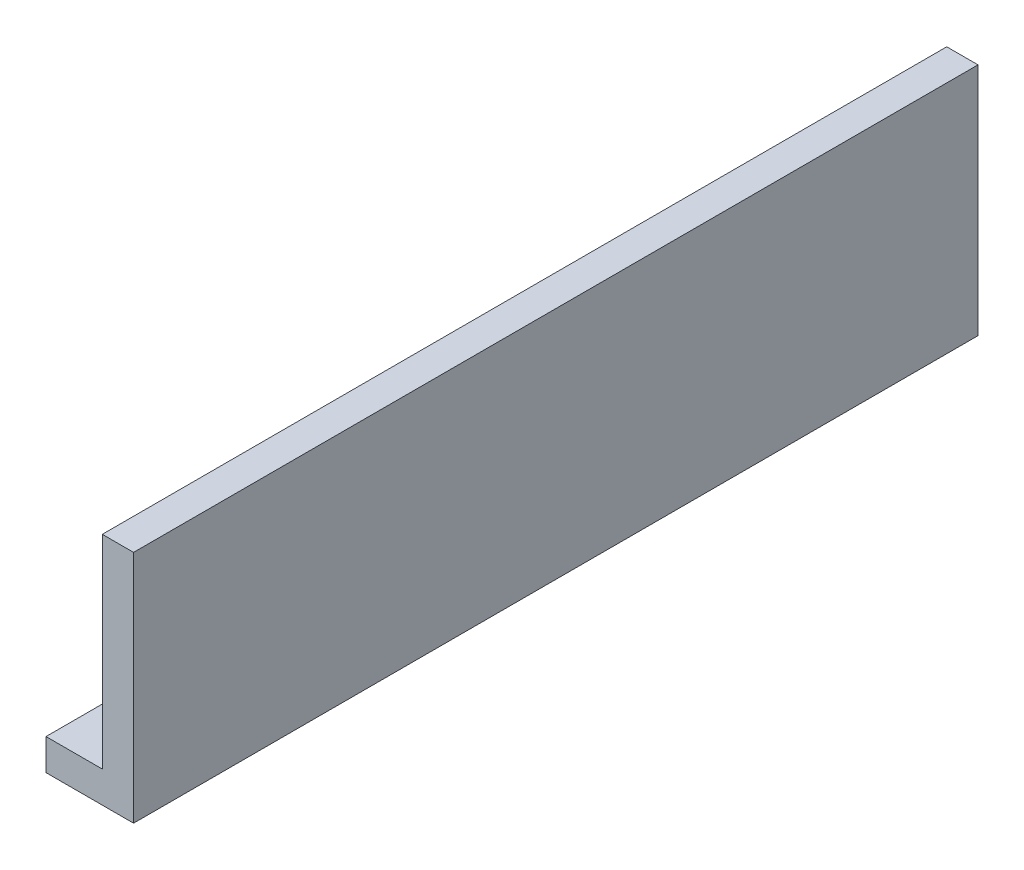
ISO-10303-21;
HEADER;
FILE_DESCRIPTION(('STEP AP214'),'2;1');
FILE_NAME('part.step','',(''),(''),'','','');
FILE_SCHEMA(('AUTOMOTIVE_DESIGN { 1 0 10303 214 1 1 1 1 }'));
ENDSEC;
DATA;
#1=APPLICATION_CONTEXT('core data for automotive mechanical design processes');
#2=APPLICATION_PROTOCOL_DEFINITION('international standard','automotive_design',2000,#1);
#3=PRODUCT_CONTEXT('',#1,'mechanical');
#4=PRODUCT('Part','Part','',(#3));
#5=PRODUCT_RELATED_PRODUCT_CATEGORY('part','',(#4));
#6=PRODUCT_DEFINITION_FORMATION('','',#4);
#7=PRODUCT_DEFINITION_CONTEXT('part definition',#1,'design');
#8=PRODUCT_DEFINITION('design','',#6,#7);
#9=PRODUCT_DEFINITION_SHAPE('','',#8);
#10=(LENGTH_UNIT() NAMED_UNIT(*) SI_UNIT(.MILLI.,.METRE.));
#11=(NAMED_UNIT(*) PLANE_ANGLE_UNIT() SI_UNIT($,.RADIAN.));
#12=(NAMED_UNIT(*) SI_UNIT($,.STERADIAN.) SOLID_ANGLE_UNIT());
#13=UNCERTAINTY_MEASURE_WITH_UNIT(LENGTH_MEASURE(1.E-05),#10,'distance_accuracy_value','');
#14=(GEOMETRIC_REPRESENTATION_CONTEXT(3) GLOBAL_UNCERTAINTY_ASSIGNED_CONTEXT((#13)) GLOBAL_UNIT_ASSIGNED_CONTEXT((#10,
#11,#12)) REPRESENTATION_CONTEXT('',''));
#15=CARTESIAN_POINT('',(0.,0.,0.));
#16=DIRECTION('',(0.,0.,1.));
#17=DIRECTION('',(1.,0.,0.));
#18=AXIS2_PLACEMENT_3D('',#15,#16,#17);
#19=CARTESIAN_POINT('',(0.,150.,270.));
#20=DIRECTION('',(1.,0.,0.));
#21=DIRECTION('',(0.,0.,-1.));
#22=AXIS2_PLACEMENT_3D('',#19,#20,#21);
#23=PLANE('',#22);
#24=DIRECTION('',(0.,-1.,0.));
#25=VECTOR('',#24,1.);
#26=CARTESIAN_POINT('',(0.,150.,-270.));
#27=LINE('',#26,#25);
#28=CARTESIAN_POINT('',(0.,150.,-270.));
#29=VERTEX_POINT('',#28);
#30=CARTESIAN_POINT('',(0.,20.,-270.));
#31=VERTEX_POINT('',#30);
#32=EDGE_CURVE('E160',#29,#31,#27,.T.);
#33=ORIENTED_EDGE('',*,*,#32,.T.);
#34=DIRECTION('',(0.,0.,1.));
#35=VECTOR('',#34,1.);
#36=CARTESIAN_POINT('',(0.,20.,270.));
#37=LINE('',#36,#35);
#38=CARTESIAN_POINT('',(0.,20.,270.));
#39=VERTEX_POINT('',#38);
#40=EDGE_CURVE('E131',#31,#39,#37,.T.);
#41=ORIENTED_EDGE('',*,*,#40,.T.);
#42=DIRECTION('',(0.,-1.,0.));
#43=VECTOR('',#42,1.);
#44=CARTESIAN_POINT('',(0.,150.,270.));
#45=LINE('',#44,#43);
#46=CARTESIAN_POINT('',(0.,150.,270.));
#47=VERTEX_POINT('',#46);
#48=EDGE_CURVE('E11',#47,#39,#45,.T.);
#49=ORIENTED_EDGE('',*,*,#48,.F.);
#50=DIRECTION('',(0.,0.,1.));
#51=VECTOR('',#50,1.);
#52=CARTESIAN_POINT('',(0.,150.,270.));
#53=LINE('',#52,#51);
#54=EDGE_CURVE('E150',#29,#47,#53,.T.);
#55=ORIENTED_EDGE('',*,*,#54,.F.);
#56=EDGE_LOOP('',(#33,#41,#49,#55));
#57=FACE_BOUND('',#56,.T.);
#58=ADVANCED_FACE('F46',(#57),#23,.F.);
#59=CARTESIAN_POINT('',(0.,150.,270.));
#60=DIRECTION('',(0.,0.,-1.));
#61=DIRECTION('',(-1.,0.,0.));
#62=AXIS2_PLACEMENT_3D('',#59,#60,#61);
#63=PLANE('',#62);
#64=DIRECTION('',(1.,0.,0.));
#65=VECTOR('',#64,1.);
#66=CARTESIAN_POINT('',(0.,0.,270.));
#67=LINE('',#66,#65);
#68=CARTESIAN_POINT('',(-36.,0.,270.));
#69=VERTEX_POINT('',#68);
#70=CARTESIAN_POINT('',(20.,0.,270.));
#71=VERTEX_POINT('',#70);
#72=EDGE_CURVE('E111',#69,#71,#67,.T.);
#73=ORIENTED_EDGE('',*,*,#72,.T.);
#74=DIRECTION('',(0.,-1.,0.));
#75=VECTOR('',#74,1.);
#76=CARTESIAN_POINT('',(20.,150.,270.));
#77=LINE('',#76,#75);
#78=CARTESIAN_POINT('',(20.,150.,270.));
#79=VERTEX_POINT('',#78);
#80=EDGE_CURVE('E55',#79,#71,#77,.T.);
#81=ORIENTED_EDGE('',*,*,#80,.F.);
#82=DIRECTION('',(1.,0.,0.));
#83=VECTOR('',#82,1.);
#84=CARTESIAN_POINT('',(0.,150.,270.));
#85=LINE('',#84,#83);
#86=EDGE_CURVE('E95',#47,#79,#85,.T.);
#87=ORIENTED_EDGE('',*,*,#86,.F.);
#88=ORIENTED_EDGE('',*,*,#48,.T.);
#89=DIRECTION('',(1.,0.,0.));
#90=VECTOR('',#89,1.);
#91=CARTESIAN_POINT('',(-36.,20.,270.));
#92=LINE('',#91,#90);
#93=CARTESIAN_POINT('',(-36.,20.,270.));
#94=VERTEX_POINT('',#93);
#95=EDGE_CURVE('E63',#94,#39,#92,.T.);
#96=ORIENTED_EDGE('',*,*,#95,.F.);
#97=DIRECTION('',(0.,-1.,0.));
#98=VECTOR('',#97,1.);
#99=CARTESIAN_POINT('',(-36.,20.,270.));
#100=LINE('',#99,#98);
#101=EDGE_CURVE('E124',#94,#69,#100,.T.);
#102=ORIENTED_EDGE('',*,*,#101,.T.);
#103=EDGE_LOOP('',(#73,#81,#87,#88,#96,#102));
#104=FACE_BOUND('',#103,.T.);
#105=ADVANCED_FACE('F129',(#104),#63,.F.);
#106=CARTESIAN_POINT('',(20.,150.,270.));
#107=DIRECTION('',(-1.,0.,0.));
#108=DIRECTION('',(0.,0.,1.));
#109=AXIS2_PLACEMENT_3D('',#106,#107,#108);
#110=PLANE('',#109);
#111=DIRECTION('',(0.,0.,-1.));
#112=VECTOR('',#111,1.);
#113=CARTESIAN_POINT('',(20.,0.,270.));
#114=LINE('',#113,#112);
#115=CARTESIAN_POINT('',(20.,0.,-270.));
#116=VERTEX_POINT('',#115);
#117=EDGE_CURVE('E88',#71,#116,#114,.T.);
#118=ORIENTED_EDGE('',*,*,#117,.T.);
#119=DIRECTION('',(0.,-1.,0.));
#120=VECTOR('',#119,1.);
#121=CARTESIAN_POINT('',(20.,150.,-270.));
#122=LINE('',#121,#120);
#123=CARTESIAN_POINT('',(20.,150.,-270.));
#124=VERTEX_POINT('',#123);
#125=EDGE_CURVE('E169',#124,#116,#122,.T.);
#126=ORIENTED_EDGE('',*,*,#125,.F.);
#127=DIRECTION('',(0.,0.,-1.));
#128=VECTOR('',#127,1.);
#129=CARTESIAN_POINT('',(20.,150.,270.));
#130=LINE('',#129,#128);
#131=EDGE_CURVE('E156',#79,#124,#130,.T.);
#132=ORIENTED_EDGE('',*,*,#131,.F.);
#133=ORIENTED_EDGE('',*,*,#80,.T.);
#134=EDGE_LOOP('',(#118,#126,#132,#133));
#135=FACE_BOUND('',#134,.T.);
#136=ADVANCED_FACE('F257',(#135),#110,.F.);
#137=CARTESIAN_POINT('',(0.,150.,-270.));
#138=DIRECTION('',(0.,0.,1.));
#139=DIRECTION('',(1.,0.,0.));
#140=AXIS2_PLACEMENT_3D('',#137,#138,#139);
#141=PLANE('',#140);
#142=DIRECTION('',(-1.,0.,0.));
#143=VECTOR('',#142,1.);
#144=CARTESIAN_POINT('',(0.,0.,-270.));
#145=LINE('',#144,#143);
#146=CARTESIAN_POINT('',(-36.,0.,-270.));
#147=VERTEX_POINT('',#146);
#148=EDGE_CURVE('E153',#116,#147,#145,.T.);
#149=ORIENTED_EDGE('',*,*,#148,.T.);
#150=DIRECTION('',(0.,1.,0.));
#151=VECTOR('',#150,1.);
#152=CARTESIAN_POINT('',(-36.,20.,-270.));
#153=LINE('',#152,#151);
#154=CARTESIAN_POINT('',(-36.,20.,-270.));
#155=VERTEX_POINT('',#154);
#156=EDGE_CURVE('E126',#147,#155,#153,.T.);
#157=ORIENTED_EDGE('',*,*,#156,.T.);
#158=DIRECTION('',(1.,0.,0.));
#159=VECTOR('',#158,1.);
#160=CARTESIAN_POINT('',(-36.,20.,-270.));
#161=LINE('',#160,#159);
#162=EDGE_CURVE('E144',#155,#31,#161,.T.);
#163=ORIENTED_EDGE('',*,*,#162,.T.);
#164=ORIENTED_EDGE('',*,*,#32,.F.);
#165=DIRECTION('',(-1.,0.,0.));
#166=VECTOR('',#165,1.);
#167=CARTESIAN_POINT('',(0.,150.,-270.));
#168=LINE('',#167,#166);
#169=EDGE_CURVE('E72',#124,#29,#168,.T.);
#170=ORIENTED_EDGE('',*,*,#169,.F.);
#171=ORIENTED_EDGE('',*,*,#125,.T.);
#172=EDGE_LOOP('',(#149,#157,#163,#164,#170,#171));
#173=FACE_BOUND('',#172,.T.);
#174=ADVANCED_FACE('F261',(#173),#141,.F.);
#175=CARTESIAN_POINT('',(0.,150.,0.));
#176=DIRECTION('',(0.,-1.,0.));
#177=DIRECTION('',(0.,0.,-1.));
#178=AXIS2_PLACEMENT_3D('',#175,#176,#177);
#179=PLANE('',#178);
#180=ORIENTED_EDGE('',*,*,#54,.T.);
#181=ORIENTED_EDGE('',*,*,#86,.T.);
#182=ORIENTED_EDGE('',*,*,#131,.T.);
#183=ORIENTED_EDGE('',*,*,#169,.T.);
#184=EDGE_LOOP('',(#180,#181,#182,#183));
#185=FACE_BOUND('',#184,.T.);
#186=ADVANCED_FACE('F271',(#185),#179,.F.);
#187=CARTESIAN_POINT('',(0.,0.,0.));
#188=DIRECTION('',(0.,-1.,0.));
#189=DIRECTION('',(0.,0.,-1.));
#190=AXIS2_PLACEMENT_3D('',#187,#188,#189);
#191=PLANE('',#190);
#192=CARTESIAN_POINT('',(-16.,0.,80.));
#193=DIRECTION('',(0.,-1.,0.));
#194=DIRECTION('',(0.,0.,-1.));
#195=AXIS2_PLACEMENT_3D('',#192,#193,#194);
#196=CIRCLE('',#195,4.25);
#197=CARTESIAN_POINT('',(-16.,0.,75.75));
#198=VERTEX_POINT('',#197);
#199=EDGE_CURVE('E49',#198,#198,#196,.T.);
#200=ORIENTED_EDGE('',*,*,#199,.F.);
#201=EDGE_LOOP('',(#200));
#202=FACE_BOUND('',#201,.T.);
#203=CARTESIAN_POINT('',(-16.,0.,160.));
#204=DIRECTION('',(0.,-1.,0.));
#205=DIRECTION('',(0.,0.,-1.));
#206=AXIS2_PLACEMENT_3D('',#203,#204,#205);
#207=CIRCLE('',#206,4.25);
#208=CARTESIAN_POINT('',(-16.,0.,155.75));
#209=VERTEX_POINT('',#208);
#210=EDGE_CURVE('E194',#209,#209,#207,.T.);
#211=ORIENTED_EDGE('',*,*,#210,.F.);
#212=EDGE_LOOP('',(#211));
#213=FACE_BOUND('',#212,.T.);
#214=CARTESIAN_POINT('',(-16.,0.,240.));
#215=DIRECTION('',(0.,-1.,0.));
#216=DIRECTION('',(0.,0.,-1.));
#217=AXIS2_PLACEMENT_3D('',#214,#215,#216);
#218=CIRCLE('',#217,4.25);
#219=CARTESIAN_POINT('',(-16.,0.,235.75));
#220=VERTEX_POINT('',#219);
#221=EDGE_CURVE('E189',#220,#220,#218,.T.);
#222=ORIENTED_EDGE('',*,*,#221,.F.);
#223=EDGE_LOOP('',(#222));
#224=FACE_BOUND('',#223,.T.);
#225=CARTESIAN_POINT('',(-16.,0.,-80.));
#226=DIRECTION('',(0.,-1.,0.));
#227=DIRECTION('',(0.,0.,-1.));
#228=AXIS2_PLACEMENT_3D('',#225,#226,#227);
#229=CIRCLE('',#228,4.25);
#230=CARTESIAN_POINT('',(-16.,0.,-84.25));
#231=VERTEX_POINT('',#230);
#232=EDGE_CURVE('E183',#231,#231,#229,.T.);
#233=ORIENTED_EDGE('',*,*,#232,.F.);
#234=EDGE_LOOP('',(#233));
#235=FACE_BOUND('',#234,.T.);
#236=CARTESIAN_POINT('',(-16.,0.,-160.));
#237=DIRECTION('',(0.,-1.,0.));
#238=DIRECTION('',(0.,0.,-1.));
#239=AXIS2_PLACEMENT_3D('',#236,#237,#238);
#240=CIRCLE('',#239,4.25);
#241=CARTESIAN_POINT('',(-16.,0.,-164.25));
#242=VERTEX_POINT('',#241);
#243=EDGE_CURVE('E177',#242,#242,#240,.T.);
#244=ORIENTED_EDGE('',*,*,#243,.F.);
#245=EDGE_LOOP('',(#244));
#246=FACE_BOUND('',#245,.T.);
#247=CARTESIAN_POINT('',(-16.,0.,-240.));
#248=DIRECTION('',(0.,-1.,0.));
#249=DIRECTION('',(0.,0.,-1.));
#250=AXIS2_PLACEMENT_3D('',#247,#248,#249);
#251=CIRCLE('',#250,4.25);
#252=CARTESIAN_POINT('',(-16.,0.,-244.25));
#253=VERTEX_POINT('',#252);
#254=EDGE_CURVE('E134',#253,#253,#251,.T.);
#255=ORIENTED_EDGE('',*,*,#254,.F.);
#256=EDGE_LOOP('',(#255));
#257=FACE_BOUND('',#256,.T.);
#258=ORIENTED_EDGE('',*,*,#72,.F.);
#259=DIRECTION('',(0.,0.,-1.));
#260=VECTOR('',#259,1.);
#261=CARTESIAN_POINT('',(-36.,0.,270.));
#262=LINE('',#261,#260);
#263=EDGE_CURVE('E115',#69,#147,#262,.T.);
#264=ORIENTED_EDGE('',*,*,#263,.T.);
#265=ORIENTED_EDGE('',*,*,#148,.F.);
#266=ORIENTED_EDGE('',*,*,#117,.F.);
#267=EDGE_LOOP('',(#258,#264,#265,#266));
#268=FACE_BOUND('',#267,.T.);
#269=ADVANCED_FACE('F113',(#202,#213,#224,#235,#246,#257,#268),#191,.T.);
#270=CARTESIAN_POINT('',(-36.,20.,270.));
#271=DIRECTION('',(0.,1.,0.));
#272=DIRECTION('',(0.,0.,1.));
#273=AXIS2_PLACEMENT_3D('',#270,#271,#272);
#274=PLANE('',#273);
#275=CARTESIAN_POINT('',(-16.,20.,80.));
#276=DIRECTION('',(0.,1.,0.));
#277=DIRECTION('',(0.,0.,1.));
#278=AXIS2_PLACEMENT_3D('',#275,#276,#277);
#279=CIRCLE('',#278,5.025);
#280=CARTESIAN_POINT('',(-16.,20.,85.025));
#281=VERTEX_POINT('',#280);
#282=EDGE_CURVE('E561',#281,#281,#279,.T.);
#283=ORIENTED_EDGE('',*,*,#282,.F.);
#284=EDGE_LOOP('',(#283));
#285=FACE_BOUND('',#284,.T.);
#286=CARTESIAN_POINT('',(-16.,20.,160.));
#287=DIRECTION('',(0.,1.,0.));
#288=DIRECTION('',(0.,0.,1.));
#289=AXIS2_PLACEMENT_3D('',#286,#287,#288);
#290=CIRCLE('',#289,5.025);
#291=CARTESIAN_POINT('',(-16.,20.,165.025));
#292=VERTEX_POINT('',#291);
#293=EDGE_CURVE('E206',#292,#292,#290,.T.);
#294=ORIENTED_EDGE('',*,*,#293,.F.);
#295=EDGE_LOOP('',(#294));
#296=FACE_BOUND('',#295,.T.);
#297=CARTESIAN_POINT('',(-16.,20.,240.));
#298=DIRECTION('',(0.,1.,0.));
#299=DIRECTION('',(0.,0.,1.));
#300=AXIS2_PLACEMENT_3D('',#297,#298,#299);
#301=CIRCLE('',#300,5.025);
#302=CARTESIAN_POINT('',(-16.,20.,245.025));
#303=VERTEX_POINT('',#302);
#304=EDGE_CURVE('E197',#303,#303,#301,.T.);
#305=ORIENTED_EDGE('',*,*,#304,.F.);
#306=EDGE_LOOP('',(#305));
#307=FACE_BOUND('',#306,.T.);
#308=CARTESIAN_POINT('',(-16.,20.,-80.));
#309=DIRECTION('',(0.,1.,0.));
#310=DIRECTION('',(0.,0.,1.));
#311=AXIS2_PLACEMENT_3D('',#308,#309,#310);
#312=CIRCLE('',#311,5.025);
#313=CARTESIAN_POINT('',(-16.,20.,-74.975));
#314=VERTEX_POINT('',#313);
#315=EDGE_CURVE('E192',#314,#314,#312,.T.);
#316=ORIENTED_EDGE('',*,*,#315,.F.);
#317=EDGE_LOOP('',(#316));
#318=FACE_BOUND('',#317,.T.);
#319=CARTESIAN_POINT('',(-16.,20.,-160.));
#320=DIRECTION('',(0.,1.,0.));
#321=DIRECTION('',(0.,0.,1.));
#322=AXIS2_PLACEMENT_3D('',#319,#320,#321);
#323=CIRCLE('',#322,5.025);
#324=CARTESIAN_POINT('',(-16.,20.,-154.975));
#325=VERTEX_POINT('',#324);
#326=EDGE_CURVE('E187',#325,#325,#323,.T.);
#327=ORIENTED_EDGE('',*,*,#326,.F.);
#328=EDGE_LOOP('',(#327));
#329=FACE_BOUND('',#328,.T.);
#330=CARTESIAN_POINT('',(-16.,20.,-240.));
#331=DIRECTION('',(0.,1.,0.));
#332=DIRECTION('',(0.,0.,1.));
#333=AXIS2_PLACEMENT_3D('',#330,#331,#332);
#334=CIRCLE('',#333,5.025);
#335=CARTESIAN_POINT('',(-16.,20.,-234.975));
#336=VERTEX_POINT('',#335);
#337=EDGE_CURVE('E181',#336,#336,#334,.T.);
#338=ORIENTED_EDGE('',*,*,#337,.F.);
#339=EDGE_LOOP('',(#338));
#340=FACE_BOUND('',#339,.T.);
#341=ORIENTED_EDGE('',*,*,#40,.F.);
#342=ORIENTED_EDGE('',*,*,#162,.F.);
#343=DIRECTION('',(0.,0.,1.));
#344=VECTOR('',#343,1.);
#345=CARTESIAN_POINT('',(-36.,20.,270.));
#346=LINE('',#345,#344);
#347=EDGE_CURVE('E142',#155,#94,#346,.T.);
#348=ORIENTED_EDGE('',*,*,#347,.T.);
#349=ORIENTED_EDGE('',*,*,#95,.T.);
#350=EDGE_LOOP('',(#341,#342,#348,#349));
#351=FACE_BOUND('',#350,.T.);
#352=ADVANCED_FACE('F262',(#285,#296,#307,#318,#329,#340,#351),#274,.T.);
#353=CARTESIAN_POINT('',(-36.,0.,0.));
#354=DIRECTION('',(1.,0.,0.));
#355=DIRECTION('',(0.,0.,-1.));
#356=AXIS2_PLACEMENT_3D('',#353,#354,#355);
#357=PLANE('',#356);
#358=ORIENTED_EDGE('',*,*,#101,.F.);
#359=ORIENTED_EDGE('',*,*,#347,.F.);
#360=ORIENTED_EDGE('',*,*,#156,.F.);
#361=ORIENTED_EDGE('',*,*,#263,.F.);
#362=EDGE_LOOP('',(#358,#359,#360,#361));
#363=FACE_BOUND('',#362,.T.);
#364=ADVANCED_FACE('F122',(#363),#357,.F.);
#365=CARTESIAN_POINT('',(-16.,20.,-240.));
#366=DIRECTION('',(0.,1.,0.));
#367=DIRECTION('',(0.,0.,1.));
#368=AXIS2_PLACEMENT_3D('',#365,#366,#367);
#369=CYLINDRICAL_SURFACE('',#368,4.25);
#370=ORIENTED_EDGE('',*,*,#254,.T.);
#371=EDGE_LOOP('',(#370));
#372=FACE_BOUND('',#371,.T.);
#373=CARTESIAN_POINT('',(-16.,19.225,-240.));
#374=DIRECTION('',(0.,1.,0.));
#375=DIRECTION('',(0.,0.,1.));
#376=AXIS2_PLACEMENT_3D('',#373,#374,#375);
#377=CIRCLE('',#376,4.25);
#378=CARTESIAN_POINT('',(-16.,19.225,-235.75));
#379=VERTEX_POINT('',#378);
#380=EDGE_CURVE('E137',#379,#379,#377,.T.);
#381=ORIENTED_EDGE('',*,*,#380,.T.);
#382=EDGE_LOOP('',(#381));
#383=FACE_BOUND('',#382,.T.);
#384=ADVANCED_FACE('F237',(#372,#383),#369,.F.);
#385=CARTESIAN_POINT('',(-16.,20.,-240.));
#386=DIRECTION('',(0.,1.,0.));
#387=DIRECTION('',(0.,0.,1.));
#388=AXIS2_PLACEMENT_3D('',#385,#386,#387);
#389=CONICAL_SURFACE('',#388,5.025,0.785398163397448);
#390=ORIENTED_EDGE('',*,*,#380,.F.);
#391=EDGE_LOOP('',(#390));
#392=FACE_BOUND('',#391,.T.);
#393=ORIENTED_EDGE('',*,*,#337,.T.);
#394=EDGE_LOOP('',(#393));
#395=FACE_BOUND('',#394,.T.);
#396=ADVANCED_FACE('F239',(#392,#395),#389,.F.);
#397=CARTESIAN_POINT('',(-16.,20.,-160.));
#398=DIRECTION('',(0.,1.,0.));
#399=DIRECTION('',(0.,0.,1.));
#400=AXIS2_PLACEMENT_3D('',#397,#398,#399);
#401=CYLINDRICAL_SURFACE('',#400,4.25);
#402=ORIENTED_EDGE('',*,*,#243,.T.);
#403=EDGE_LOOP('',(#402));
#404=FACE_BOUND('',#403,.T.);
#405=CARTESIAN_POINT('',(-16.,19.225,-160.));
#406=DIRECTION('',(0.,1.,0.));
#407=DIRECTION('',(0.,0.,1.));
#408=AXIS2_PLACEMENT_3D('',#405,#406,#407);
#409=CIRCLE('',#408,4.25);
#410=CARTESIAN_POINT('',(-16.,19.225,-155.75));
#411=VERTEX_POINT('',#410);
#412=EDGE_CURVE('E182',#411,#411,#409,.T.);
#413=ORIENTED_EDGE('',*,*,#412,.T.);
#414=EDGE_LOOP('',(#413));
#415=FACE_BOUND('',#414,.T.);
#416=ADVANCED_FACE('F241',(#404,#415),#401,.F.);
#417=CARTESIAN_POINT('',(-16.,20.,-160.));
#418=DIRECTION('',(0.,1.,0.));
#419=DIRECTION('',(0.,0.,1.));
#420=AXIS2_PLACEMENT_3D('',#417,#418,#419);
#421=CONICAL_SURFACE('',#420,5.025,0.785398163397448);
#422=ORIENTED_EDGE('',*,*,#412,.F.);
#423=EDGE_LOOP('',(#422));
#424=FACE_BOUND('',#423,.T.);
#425=ORIENTED_EDGE('',*,*,#326,.T.);
#426=EDGE_LOOP('',(#425));
#427=FACE_BOUND('',#426,.T.);
#428=ADVANCED_FACE('F247',(#424,#427),#421,.F.);
#429=CARTESIAN_POINT('',(-16.,20.,-80.));
#430=DIRECTION('',(0.,1.,0.));
#431=DIRECTION('',(0.,0.,1.));
#432=AXIS2_PLACEMENT_3D('',#429,#430,#431);
#433=CYLINDRICAL_SURFACE('',#432,4.25);
#434=ORIENTED_EDGE('',*,*,#232,.T.);
#435=EDGE_LOOP('',(#434));
#436=FACE_BOUND('',#435,.T.);
#437=CARTESIAN_POINT('',(-16.,19.225,-80.));
#438=DIRECTION('',(0.,1.,0.));
#439=DIRECTION('',(0.,0.,1.));
#440=AXIS2_PLACEMENT_3D('',#437,#438,#439);
#441=CIRCLE('',#440,4.25);
#442=CARTESIAN_POINT('',(-16.,19.225,-75.75));
#443=VERTEX_POINT('',#442);
#444=EDGE_CURVE('E188',#443,#443,#441,.T.);
#445=ORIENTED_EDGE('',*,*,#444,.T.);
#446=EDGE_LOOP('',(#445));
#447=FACE_BOUND('',#446,.T.);
#448=ADVANCED_FACE('F412',(#436,#447),#433,.F.);
#449=CARTESIAN_POINT('',(-16.,20.,-80.));
#450=DIRECTION('',(0.,1.,0.));
#451=DIRECTION('',(0.,0.,1.));
#452=AXIS2_PLACEMENT_3D('',#449,#450,#451);
#453=CONICAL_SURFACE('',#452,5.025,0.785398163397448);
#454=ORIENTED_EDGE('',*,*,#444,.F.);
#455=EDGE_LOOP('',(#454));
#456=FACE_BOUND('',#455,.T.);
#457=ORIENTED_EDGE('',*,*,#315,.T.);
#458=EDGE_LOOP('',(#457));
#459=FACE_BOUND('',#458,.T.);
#460=ADVANCED_FACE('F307',(#456,#459),#453,.F.);
#461=CARTESIAN_POINT('',(-16.,20.,240.));
#462=DIRECTION('',(0.,1.,0.));
#463=DIRECTION('',(0.,0.,1.));
#464=AXIS2_PLACEMENT_3D('',#461,#462,#463);
#465=CYLINDRICAL_SURFACE('',#464,4.25);
#466=ORIENTED_EDGE('',*,*,#221,.T.);
#467=EDGE_LOOP('',(#466));
#468=FACE_BOUND('',#467,.T.);
#469=CARTESIAN_POINT('',(-16.,19.225,240.));
#470=DIRECTION('',(0.,1.,0.));
#471=DIRECTION('',(0.,0.,1.));
#472=AXIS2_PLACEMENT_3D('',#469,#470,#471);
#473=CIRCLE('',#472,4.25);
#474=CARTESIAN_POINT('',(-16.,19.225,244.25));
#475=VERTEX_POINT('',#474);
#476=EDGE_CURVE('E193',#475,#475,#473,.T.);
#477=ORIENTED_EDGE('',*,*,#476,.T.);
#478=EDGE_LOOP('',(#477));
#479=FACE_BOUND('',#478,.T.);
#480=ADVANCED_FACE('F323',(#468,#479),#465,.F.);
#481=CARTESIAN_POINT('',(-16.,20.,240.));
#482=DIRECTION('',(0.,1.,0.));
#483=DIRECTION('',(0.,0.,1.));
#484=AXIS2_PLACEMENT_3D('',#481,#482,#483);
#485=CONICAL_SURFACE('',#484,5.025,0.785398163397448);
#486=ORIENTED_EDGE('',*,*,#476,.F.);
#487=EDGE_LOOP('',(#486));
#488=FACE_BOUND('',#487,.T.);
#489=ORIENTED_EDGE('',*,*,#304,.T.);
#490=EDGE_LOOP('',(#489));
#491=FACE_BOUND('',#490,.T.);
#492=ADVANCED_FACE('F329',(#488,#491),#485,.F.);
#493=CARTESIAN_POINT('',(-16.,20.,160.));
#494=DIRECTION('',(0.,1.,0.));
#495=DIRECTION('',(0.,0.,1.));
#496=AXIS2_PLACEMENT_3D('',#493,#494,#495);
#497=CYLINDRICAL_SURFACE('',#496,4.25);
#498=ORIENTED_EDGE('',*,*,#210,.T.);
#499=EDGE_LOOP('',(#498));
#500=FACE_BOUND('',#499,.T.);
#501=CARTESIAN_POINT('',(-16.,19.225,160.));
#502=DIRECTION('',(0.,1.,0.));
#503=DIRECTION('',(0.,0.,1.));
#504=AXIS2_PLACEMENT_3D('',#501,#502,#503);
#505=CIRCLE('',#504,4.25);
#506=CARTESIAN_POINT('',(-16.,19.225,164.25));
#507=VERTEX_POINT('',#506);
#508=EDGE_CURVE('E198',#507,#507,#505,.T.);
#509=ORIENTED_EDGE('',*,*,#508,.T.);
#510=EDGE_LOOP('',(#509));
#511=FACE_BOUND('',#510,.T.);
#512=ADVANCED_FACE('F343',(#500,#511),#497,.F.);
#513=CARTESIAN_POINT('',(-16.,20.,160.));
#514=DIRECTION('',(0.,1.,0.));
#515=DIRECTION('',(0.,0.,1.));
#516=AXIS2_PLACEMENT_3D('',#513,#514,#515);
#517=CONICAL_SURFACE('',#516,5.025,0.785398163397448);
#518=ORIENTED_EDGE('',*,*,#508,.F.);
#519=EDGE_LOOP('',(#518));
#520=FACE_BOUND('',#519,.T.);
#521=ORIENTED_EDGE('',*,*,#293,.T.);
#522=EDGE_LOOP('',(#521));
#523=FACE_BOUND('',#522,.T.);
#524=ADVANCED_FACE('F355',(#520,#523),#517,.F.);
#525=CARTESIAN_POINT('',(-16.,20.,80.));
#526=DIRECTION('',(0.,1.,0.));
#527=DIRECTION('',(0.,0.,1.));
#528=AXIS2_PLACEMENT_3D('',#525,#526,#527);
#529=CYLINDRICAL_SURFACE('',#528,4.25);
#530=ORIENTED_EDGE('',*,*,#199,.T.);
#531=EDGE_LOOP('',(#530));
#532=FACE_BOUND('',#531,.T.);
#533=CARTESIAN_POINT('',(-16.,19.225,80.));
#534=DIRECTION('',(0.,1.,0.));
#535=DIRECTION('',(0.,0.,1.));
#536=AXIS2_PLACEMENT_3D('',#533,#534,#535);
#537=CIRCLE('',#536,4.25);
#538=CARTESIAN_POINT('',(-16.,19.225,84.25));
#539=VERTEX_POINT('',#538);
#540=EDGE_CURVE('E559',#539,#539,#537,.T.);
#541=ORIENTED_EDGE('',*,*,#540,.T.);
#542=EDGE_LOOP('',(#541));
#543=FACE_BOUND('',#542,.T.);
#544=ADVANCED_FACE('F366',(#532,#543),#529,.F.);
#545=CARTESIAN_POINT('',(-16.,20.,80.));
#546=DIRECTION('',(0.,1.,0.));
#547=DIRECTION('',(0.,0.,1.));
#548=AXIS2_PLACEMENT_3D('',#545,#546,#547);
#549=CONICAL_SURFACE('',#548,5.025,0.785398163397448);
#550=ORIENTED_EDGE('',*,*,#540,.F.);
#551=EDGE_LOOP('',(#550));
#552=FACE_BOUND('',#551,.T.);
#553=ORIENTED_EDGE('',*,*,#282,.T.);
#554=EDGE_LOOP('',(#553));
#555=FACE_BOUND('',#554,.T.);
#556=ADVANCED_FACE('F378',(#552,#555),#549,.F.);
#557=CLOSED_SHELL('',(#58,#105,#136,#174,#186,#269,#352,#364,#384,#396,#416,#428,#448,#460,#480,
#492,#512,#524,#544,#556));
#558=MANIFOLD_SOLID_BREP('B2',#557);
#559=ADVANCED_BREP_SHAPE_REPRESENTATION('',(#18,#558),#14);
#560=SHAPE_DEFINITION_REPRESENTATION(#9,#559);
ENDSEC;
END-ISO-10303-21;
